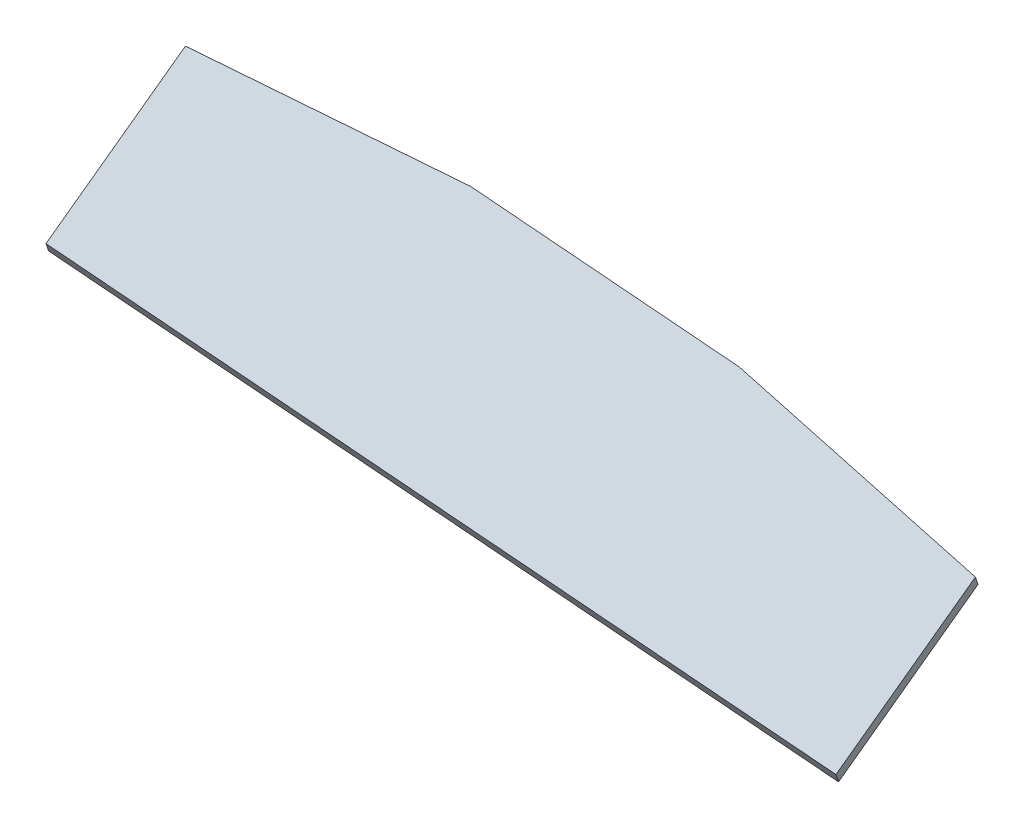
ISO-10303-21;
HEADER;
FILE_DESCRIPTION(('STEP AP214'),'2;1');
FILE_NAME('part.step','',(''),(''),'','','');
FILE_SCHEMA(('AUTOMOTIVE_DESIGN { 1 0 10303 214 1 1 1 1 }'));
ENDSEC;
DATA;
#1=APPLICATION_CONTEXT('core data for automotive mechanical design processes');
#2=APPLICATION_PROTOCOL_DEFINITION('international standard','automotive_design',2000,#1);
#3=PRODUCT_CONTEXT('',#1,'mechanical');
#4=PRODUCT('Part','Part','',(#3));
#5=PRODUCT_RELATED_PRODUCT_CATEGORY('part','',(#4));
#6=PRODUCT_DEFINITION_FORMATION('','',#4);
#7=PRODUCT_DEFINITION_CONTEXT('part definition',#1,'design');
#8=PRODUCT_DEFINITION('design','',#6,#7);
#9=PRODUCT_DEFINITION_SHAPE('','',#8);
#10=(LENGTH_UNIT() NAMED_UNIT(*) SI_UNIT(.MILLI.,.METRE.));
#11=(NAMED_UNIT(*) PLANE_ANGLE_UNIT() SI_UNIT($,.RADIAN.));
#12=(NAMED_UNIT(*) SI_UNIT($,.STERADIAN.) SOLID_ANGLE_UNIT());
#13=UNCERTAINTY_MEASURE_WITH_UNIT(LENGTH_MEASURE(1.E-05),#10,'distance_accuracy_value','');
#14=(GEOMETRIC_REPRESENTATION_CONTEXT(3) GLOBAL_UNCERTAINTY_ASSIGNED_CONTEXT((#13)) GLOBAL_UNIT_ASSIGNED_CONTEXT((#10,
#11,#12)) REPRESENTATION_CONTEXT('',''));
#15=CARTESIAN_POINT('',(0.,0.,0.));
#16=DIRECTION('',(0.,0.,1.));
#17=DIRECTION('',(1.,0.,0.));
#18=AXIS2_PLACEMENT_3D('',#15,#16,#17);
#19=CARTESIAN_POINT('',(124.,98.0742362562816,-225.662396250145));
#20=DIRECTION('',(0.903470789906189,-0.346784860297949,-0.251953949074866));
#21=DIRECTION('',(-0.411294235020629,-0.53576780583598,-0.737421121523174));
#22=AXIS2_PLACEMENT_3D('',#19,#20,#21);
#23=PLANE('',#22);
#24=DIRECTION('',(0.,0.587785252292484,-0.80901699437494));
#25=VECTOR('',#24,1.);
#26=CARTESIAN_POINT('',(119.71350339104,43.7421838433283,-166.251504761989));
#27=LINE('',#26,#25);
#28=CARTESIAN_POINT('',(119.71350339104,43.7421838433283,-166.251504761989));
#29=VERTEX_POINT('',#28);
#30=CARTESIAN_POINT('',(119.71350339104,83.711580999217,-221.264660379485));
#31=VERTEX_POINT('',#30);
#32=EDGE_CURVE('E106',#29,#31,#27,.T.);
#33=ORIENTED_EDGE('',*,*,#32,.T.);
#34=DIRECTION('',(0.428649660896038,0.730923222955457,0.531046806183898));
#35=VECTOR('',#34,1.);
#36=CARTESIAN_POINT('',(1.29384842199945,-118.214802636105,-367.972765616876));
#37=LINE('',#36,#35);
#38=CARTESIAN_POINT('',(124.,91.0208132287716,-215.954192317646));
#39=VERTEX_POINT('',#38);
#40=EDGE_CURVE('E55',#31,#39,#37,.T.);
#41=ORIENTED_EDGE('',*,*,#40,.T.);
#42=DIRECTION('',(0.,-0.587785252292484,0.80901699437494));
#43=VECTOR('',#42,1.);
#44=CARTESIAN_POINT('',(124.,51.0514160728829,-160.94103670015));
#45=LINE('',#44,#43);
#46=CARTESIAN_POINT('',(124.,51.0514160728829,-160.94103670015));
#47=VERTEX_POINT('',#46);
#48=EDGE_CURVE('E103',#39,#47,#45,.T.);
#49=ORIENTED_EDGE('',*,*,#48,.T.);
#50=DIRECTION('',(-0.428649660896037,-0.730923222955458,-0.531046806183897));
#51=VECTOR('',#50,1.);
#52=CARTESIAN_POINT('',(124.,51.0514160728829,-160.94103670015));
#53=LINE('',#52,#51);
#54=EDGE_CURVE('E116',#47,#29,#53,.T.);
#55=ORIENTED_EDGE('',*,*,#54,.T.);
#56=EDGE_LOOP('',(#33,#41,#49,#55));
#57=FACE_BOUND('',#56,.T.);
#58=ADVANCED_FACE('F41',(#57),#23,.T.);
#59=CARTESIAN_POINT('',(-122.85675169552,145.803991481796,-92.0992610275378));
#60=DIRECTION('',(-0.428649660896038,-0.730923222955457,-0.531046806183898));
#61=DIRECTION('',(-0.894833483572199,0.262387387105231,0.361145255771321));
#62=AXIS2_PLACEMENT_3D('',#59,#60,#61);
#63=PLANE('',#62);
#64=DIRECTION('',(-0.895368758447917,0.422216245278693,0.14159176748031));
#65=VECTOR('',#64,1.);
#66=CARTESIAN_POINT('',(31.6224809668157,134.581959255312,-201.345802118698));
#67=LINE('',#66,#65);
#68=CARTESIAN_POINT('',(43.5910996983472,128.9380888228,-203.238494782482));
#69=VERTEX_POINT('',#68);
#70=EDGE_CURVE('E91',#39,#69,#67,.T.);
#71=ORIENTED_EDGE('',*,*,#70,.T.);
#72=DIRECTION('',(0.903470789906188,-0.346784860297949,-0.251953949074866));
#73=VECTOR('',#72,1.);
#74=CARTESIAN_POINT('',(-122.85675169552,192.826811665195,-156.820620577533));
#75=LINE('',#74,#73);
#76=CARTESIAN_POINT('',(-39.3046030893882,160.756466385986,-180.121090310695));
#77=VERTEX_POINT('',#76);
#78=EDGE_CURVE('E125',#77,#69,#75,.T.);
#79=ORIENTED_EDGE('',*,*,#78,.F.);
#80=DIRECTION('',(0.895368758447917,-0.265133768208185,-0.357797248942979));
#81=VECTOR('',#80,1.);
#82=CARTESIAN_POINT('',(-27.3359843578554,157.212356817054,-184.903855864424));
#83=LINE('',#82,#81);
#84=CARTESIAN_POINT('',(-119.71350339104,184.566895924994,-147.988984910532));
#85=VERTEX_POINT('',#84);
#86=EDGE_CURVE('E141',#85,#77,#83,.T.);
#87=ORIENTED_EDGE('',*,*,#86,.F.);
#88=DIRECTION('',(0.,-0.587785252292484,0.80901699437494));
#89=VECTOR('',#88,1.);
#90=CARTESIAN_POINT('',(-119.71350339104,144.597498769105,-92.9758292930364));
#91=LINE('',#90,#89);
#92=CARTESIAN_POINT('',(-119.71350339104,144.597498769105,-92.9758292930364));
#93=VERTEX_POINT('',#92);
#94=EDGE_CURVE('E126',#85,#93,#91,.T.);
#95=ORIENTED_EDGE('',*,*,#94,.T.);
#96=DIRECTION('',(0.903470789906188,-0.346784860297949,-0.251953949074866));
#97=VECTOR('',#96,1.);
#98=CARTESIAN_POINT('',(-122.85675169552,145.803991481796,-92.0992610275378));
#99=LINE('',#98,#97);
#100=EDGE_CURVE('E110',#93,#47,#99,.T.);
#101=ORIENTED_EDGE('',*,*,#100,.T.);
#102=ORIENTED_EDGE('',*,*,#48,.F.);
#103=EDGE_LOOP('',(#71,#79,#87,#95,#101,#102));
#104=FACE_BOUND('',#103,.T.);
#105=ADVANCED_FACE('F108',(#104),#63,.F.);
#106=CARTESIAN_POINT('',(-127.14324830448,185.51757943564,-162.131088639372));
#107=DIRECTION('',(0.,-0.587785252292482,0.809016994374941));
#108=DIRECTION('',(0.,-0.809016994374941,-0.587785252292482));
#109=AXIS2_PLACEMENT_3D('',#106,#107,#108);
#110=PLANE('',#109);
#111=DIRECTION('',(0.428649660896038,0.730923222955457,0.531046806183898));
#112=VECTOR('',#111,1.);
#113=CARTESIAN_POINT('',(-79.1150518796534,-80.297527042077,-355.257068081712));
#114=LINE('',#113,#112);
#115=CARTESIAN_POINT('',(39.3046030893868,121.628856593245,-208.548962844321));
#116=VERTEX_POINT('',#115);
#117=EDGE_CURVE('E94',#116,#69,#114,.T.);
#118=ORIENTED_EDGE('',*,*,#117,.F.);
#119=DIRECTION('',(0.903470789906188,-0.346784860297949,-0.251953949074866));
#120=VECTOR('',#119,1.);
#121=CARTESIAN_POINT('',(-127.14324830448,185.51757943564,-162.131088639372));
#122=LINE('',#121,#120);
#123=CARTESIAN_POINT('',(-43.5910996983486,153.447234156431,-185.431558372534));
#124=VERTEX_POINT('',#123);
#125=EDGE_CURVE('E124',#124,#116,#122,.T.);
#126=ORIENTED_EDGE('',*,*,#125,.F.);
#127=DIRECTION('',(0.428649660896038,0.730923222955457,0.531046806183898));
#128=VECTOR('',#127,1.);
#129=CARTESIAN_POINT('',(-162.010754667389,-48.4791494788909,-332.139663609925));
#130=LINE('',#129,#128);
#131=EDGE_CURVE('E63',#124,#77,#130,.T.);
#132=ORIENTED_EDGE('',*,*,#131,.T.);
#133=ORIENTED_EDGE('',*,*,#78,.T.);
#134=EDGE_LOOP('',(#118,#126,#132,#133));
#135=FACE_BOUND('',#134,.T.);
#136=ADVANCED_FACE('F155',(#135),#110,.F.);
#137=CARTESIAN_POINT('',(-127.14324830448,138.494759252241,-97.4097290893768));
#138=DIRECTION('',(0.428649660896038,0.730923222955457,0.531046806183898));
#139=DIRECTION('',(0.894833483572199,-0.262387387105231,-0.361145255771321));
#140=AXIS2_PLACEMENT_3D('',#137,#138,#139);
#141=PLANE('',#140);
#142=DIRECTION('',(-0.895368758447917,0.422216245278693,0.14159176748031));
#143=VECTOR('',#142,1.);
#144=CARTESIAN_POINT('',(-114.600032571027,194.203465419409,-184.210801409756));
#145=LINE('',#144,#143);
#146=EDGE_CURVE('E12',#31,#116,#145,.T.);
#147=ORIENTED_EDGE('',*,*,#146,.F.);
#148=ORIENTED_EDGE('',*,*,#32,.F.);
#149=DIRECTION('',(0.903470789906188,-0.346784860297949,-0.251953949074866));
#150=VECTOR('',#149,1.);
#151=CARTESIAN_POINT('',(-127.14324830448,138.494759252241,-97.4097290893768));
#152=LINE('',#151,#150);
#153=CARTESIAN_POINT('',(-124.,137.28826653955,-98.2862973548753));
#154=VERTEX_POINT('',#153);
#155=EDGE_CURVE('E114',#154,#29,#152,.T.);
#156=ORIENTED_EDGE('',*,*,#155,.F.);
#157=DIRECTION('',(0.,0.587785252292484,-0.80901699437494));
#158=VECTOR('',#157,1.);
#159=CARTESIAN_POINT('',(-124.,137.28826653955,-98.2862973548753));
#160=LINE('',#159,#158);
#161=CARTESIAN_POINT('',(-124.,177.257663695439,-153.299452972371));
#162=VERTEX_POINT('',#161);
#163=EDGE_CURVE('E121',#154,#162,#160,.T.);
#164=ORIENTED_EDGE('',*,*,#163,.T.);
#165=DIRECTION('',(0.895368758447917,-0.265133768208185,-0.357797248942979));
#166=VECTOR('',#165,1.);
#167=CARTESIAN_POINT('',(-135.222731861864,180.580903600843,-148.814750387081));
#168=LINE('',#167,#166);
#169=EDGE_CURVE('E49',#162,#124,#168,.T.);
#170=ORIENTED_EDGE('',*,*,#169,.T.);
#171=ORIENTED_EDGE('',*,*,#125,.T.);
#172=EDGE_LOOP('',(#147,#148,#156,#164,#170,#171));
#173=FACE_BOUND('',#172,.T.);
#174=ADVANCED_FACE('F151',(#173),#141,.F.);
#175=CARTESIAN_POINT('',(-121.85675169552,46.7730413481109,33.9826037035569));
#176=DIRECTION('',(0.903470789906188,-0.346784860297949,-0.251953949074866));
#177=DIRECTION('',(-0.411294235020629,-0.53576780583598,-0.737421121523174));
#178=AXIS2_PLACEMENT_3D('',#175,#176,#177);
#179=PLANE('',#178);
#180=ORIENTED_EDGE('',*,*,#94,.F.);
#181=DIRECTION('',(0.428649660896038,0.730923222955457,0.531046806183898));
#182=VECTOR('',#181,1.);
#183=CARTESIAN_POINT('',(-242.41965496904,-24.668719939883,-300.007558209763));
#184=LINE('',#183,#182);
#185=EDGE_CURVE('E144',#162,#85,#184,.T.);
#186=ORIENTED_EDGE('',*,*,#185,.F.);
#187=ORIENTED_EDGE('',*,*,#163,.F.);
#188=DIRECTION('',(-0.428649660896038,-0.730923222955458,-0.531046806183897));
#189=VECTOR('',#188,1.);
#190=CARTESIAN_POINT('',(-119.71350339104,144.597498769105,-92.9758292930364));
#191=LINE('',#190,#189);
#192=EDGE_CURVE('E112',#93,#154,#191,.T.);
#193=ORIENTED_EDGE('',*,*,#192,.F.);
#194=EDGE_LOOP('',(#180,#186,#187,#193));
#195=FACE_BOUND('',#194,.T.);
#196=ADVANCED_FACE('F43',(#195),#179,.F.);
#197=CARTESIAN_POINT('',(-122.85675169552,145.803991481796,-92.0992610275378));
#198=DIRECTION('',(0.,0.587785252292482,-0.809016994374941));
#199=DIRECTION('',(0.,0.809016994374941,0.587785252292482));
#200=AXIS2_PLACEMENT_3D('',#197,#198,#199);
#201=PLANE('',#200);
#202=ORIENTED_EDGE('',*,*,#100,.F.);
#203=ORIENTED_EDGE('',*,*,#192,.T.);
#204=ORIENTED_EDGE('',*,*,#155,.T.);
#205=ORIENTED_EDGE('',*,*,#54,.F.);
#206=EDGE_LOOP('',(#202,#203,#204,#205));
#207=FACE_BOUND('',#206,.T.);
#208=ADVANCED_FACE('F147',(#207),#201,.F.);
#209=CARTESIAN_POINT('',(-150.042135935856,-52.0232590478233,-336.922429163654));
#210=DIRECTION('',(0.120723877543539,-0.628852388959551,0.768095318492905));
#211=DIRECTION('',(0.,-0.773754460878073,-0.63348562278183));
#212=AXIS2_PLACEMENT_3D('',#209,#210,#211);
#213=PLANE('',#212);
#214=ORIENTED_EDGE('',*,*,#185,.T.);
#215=ORIENTED_EDGE('',*,*,#86,.T.);
#216=ORIENTED_EDGE('',*,*,#131,.F.);
#217=ORIENTED_EDGE('',*,*,#169,.F.);
#218=EDGE_LOOP('',(#214,#215,#216,#217));
#219=FACE_BOUND('',#218,.T.);
#220=ADVANCED_FACE('F160',(#219),#213,.F.);
#221=CARTESIAN_POINT('',(-91.0836706111849,-74.6536566095647,-353.364375417929));
#222=DIRECTION('',(0.120723877543539,0.536175982646714,-0.835428669021888));
#223=DIRECTION('',(0.,0.841583907410689,0.540126398898773));
#224=AXIS2_PLACEMENT_3D('',#221,#222,#223);
#225=PLANE('',#224);
#226=ORIENTED_EDGE('',*,*,#146,.T.);
#227=ORIENTED_EDGE('',*,*,#117,.T.);
#228=ORIENTED_EDGE('',*,*,#70,.F.);
#229=ORIENTED_EDGE('',*,*,#40,.F.);
#230=EDGE_LOOP('',(#226,#227,#228,#229));
#231=FACE_BOUND('',#230,.T.);
#232=ADVANCED_FACE('F92',(#231),#225,.T.);
#233=CLOSED_SHELL('',(#58,#105,#136,#174,#196,#208,#220,#232));
#234=MANIFOLD_SOLID_BREP('B2',#233);
#235=ADVANCED_BREP_SHAPE_REPRESENTATION('',(#18,#234),#14);
#236=SHAPE_DEFINITION_REPRESENTATION(#9,#235);
ENDSEC;
END-ISO-10303-21;
